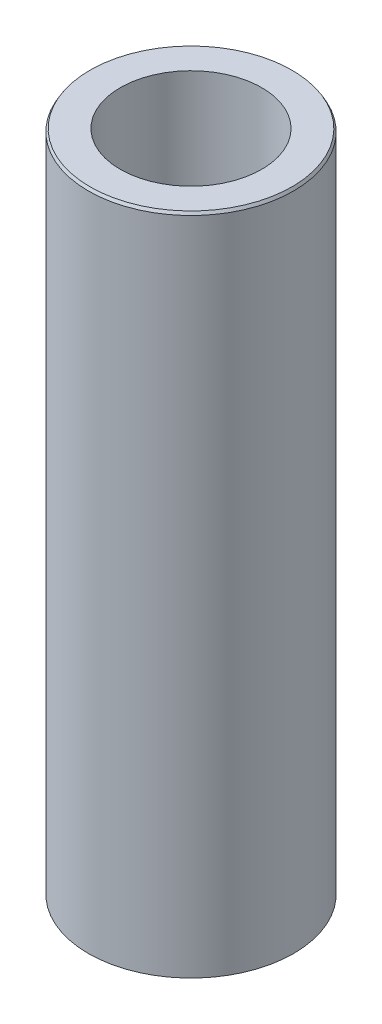
ISO-10303-21;
HEADER;
FILE_DESCRIPTION(('STEP AP214'),'2;1');
FILE_NAME('part.step','',(''),(''),'','','');
FILE_SCHEMA(('AUTOMOTIVE_DESIGN { 1 0 10303 214 1 1 1 1 }'));
ENDSEC;
DATA;
#1=APPLICATION_CONTEXT('core data for automotive mechanical design processes');
#2=APPLICATION_PROTOCOL_DEFINITION('international standard','automotive_design',2000,#1);
#3=PRODUCT_CONTEXT('',#1,'mechanical');
#4=PRODUCT('Part','Part','',(#3));
#5=PRODUCT_RELATED_PRODUCT_CATEGORY('part','',(#4));
#6=PRODUCT_DEFINITION_FORMATION('','',#4);
#7=PRODUCT_DEFINITION_CONTEXT('part definition',#1,'design');
#8=PRODUCT_DEFINITION('design','',#6,#7);
#9=PRODUCT_DEFINITION_SHAPE('','',#8);
#10=(LENGTH_UNIT() NAMED_UNIT(*) SI_UNIT(.MILLI.,.METRE.));
#11=(NAMED_UNIT(*) PLANE_ANGLE_UNIT() SI_UNIT($,.RADIAN.));
#12=(NAMED_UNIT(*) SI_UNIT($,.STERADIAN.) SOLID_ANGLE_UNIT());
#13=UNCERTAINTY_MEASURE_WITH_UNIT(LENGTH_MEASURE(1.E-05),#10,'distance_accuracy_value','');
#14=(GEOMETRIC_REPRESENTATION_CONTEXT(3) GLOBAL_UNCERTAINTY_ASSIGNED_CONTEXT((#13)) GLOBAL_UNIT_ASSIGNED_CONTEXT((#10,
#11,#12)) REPRESENTATION_CONTEXT('',''));
#15=CARTESIAN_POINT('',(0.,0.,0.));
#16=DIRECTION('',(0.,0.,1.));
#17=DIRECTION('',(1.,0.,0.));
#18=AXIS2_PLACEMENT_3D('',#15,#16,#17);
#19=CARTESIAN_POINT('',(0.,259.075646590903,0.));
#20=DIRECTION('',(0.,-1.,0.));
#21=DIRECTION('',(0.,0.,-1.));
#22=AXIS2_PLACEMENT_3D('',#19,#20,#21);
#23=CYLINDRICAL_SURFACE('',#22,40.);
#24=CARTESIAN_POINT('',(0.,257.984166966199,0.));
#25=DIRECTION('',(0.,1.,0.));
#26=DIRECTION('',(0.,0.,1.));
#27=AXIS2_PLACEMENT_3D('',#24,#25,#26);
#28=CIRCLE('',#27,40.);
#29=CARTESIAN_POINT('',(0.,257.984166966199,40.));
#30=VERTEX_POINT('',#29);
#31=EDGE_CURVE('E50',#30,#30,#28,.F.);
#32=ORIENTED_EDGE('',*,*,#31,.T.);
#33=EDGE_LOOP('',(#32));
#34=FACE_BOUND('',#33,.T.);
#35=CARTESIAN_POINT('',(0.,0.630166055137771,0.));
#36=DIRECTION('',(0.,1.,0.));
#37=DIRECTION('',(0.,0.,1.));
#38=AXIS2_PLACEMENT_3D('',#35,#36,#37);
#39=CIRCLE('',#38,40.);
#40=CARTESIAN_POINT('',(0.,0.630166055137771,40.));
#41=VERTEX_POINT('',#40);
#42=EDGE_CURVE('E51',#41,#41,#39,.T.);
#43=ORIENTED_EDGE('',*,*,#42,.T.);
#44=EDGE_LOOP('',(#43));
#45=FACE_BOUND('',#44,.T.);
#46=ADVANCED_FACE('F39',(#34,#45),#23,.T.);
#47=CARTESIAN_POINT('',(0.,259.075646590903,0.));
#48=DIRECTION('',(0.,1.,0.));
#49=DIRECTION('',(0.,0.,1.));
#50=AXIS2_PLACEMENT_3D('',#47,#48,#49);
#51=PLANE('',#50);
#52=CARTESIAN_POINT('',(0.,259.075646590903,0.));
#53=DIRECTION('',(0.,1.,0.));
#54=DIRECTION('',(0.,0.,1.));
#55=AXIS2_PLACEMENT_3D('',#52,#53,#54);
#56=CIRCLE('',#55,39.3698339448623);
#57=CARTESIAN_POINT('',(0.,259.075646590903,39.3698339448623));
#58=VERTEX_POINT('',#57);
#59=EDGE_CURVE('E54',#58,#58,#56,.T.);
#60=ORIENTED_EDGE('',*,*,#59,.T.);
#61=EDGE_LOOP('',(#60));
#62=FACE_BOUND('',#61,.T.);
#63=CARTESIAN_POINT('',(0.,259.075646590903,0.));
#64=DIRECTION('',(0.,1.,0.));
#65=DIRECTION('',(0.,0.,1.));
#66=AXIS2_PLACEMENT_3D('',#63,#64,#65);
#67=CIRCLE('',#66,27.580915956012);
#68=CARTESIAN_POINT('',(0.,259.075646590903,27.580915956012));
#69=VERTEX_POINT('',#68);
#70=EDGE_CURVE('E58',#69,#69,#67,.T.);
#71=ORIENTED_EDGE('',*,*,#70,.F.);
#72=EDGE_LOOP('',(#71));
#73=FACE_BOUND('',#72,.T.);
#74=ADVANCED_FACE('F69',(#62,#73),#51,.T.);
#75=CARTESIAN_POINT('',(0.,0.,0.));
#76=DIRECTION('',(0.,1.,0.));
#77=DIRECTION('',(0.,0.,1.));
#78=AXIS2_PLACEMENT_3D('',#75,#76,#77);
#79=PLANE('',#78);
#80=CARTESIAN_POINT('',(0.,0.,0.));
#81=DIRECTION('',(0.,1.,0.));
#82=DIRECTION('',(0.,0.,1.));
#83=AXIS2_PLACEMENT_3D('',#80,#81,#82);
#84=CIRCLE('',#83,38.9085203752961);
#85=CARTESIAN_POINT('',(0.,0.,38.9085203752961));
#86=VERTEX_POINT('',#85);
#87=EDGE_CURVE('E10',#86,#86,#84,.F.);
#88=ORIENTED_EDGE('',*,*,#87,.T.);
#89=EDGE_LOOP('',(#88));
#90=FACE_BOUND('',#89,.T.);
#91=CARTESIAN_POINT('',(0.,0.,0.));
#92=DIRECTION('',(0.,1.,0.));
#93=DIRECTION('',(0.,0.,1.));
#94=AXIS2_PLACEMENT_3D('',#91,#92,#93);
#95=CIRCLE('',#94,27.580915956012);
#96=CARTESIAN_POINT('',(0.,0.,27.580915956012));
#97=VERTEX_POINT('',#96);
#98=EDGE_CURVE('E63',#97,#97,#95,.T.);
#99=ORIENTED_EDGE('',*,*,#98,.T.);
#100=EDGE_LOOP('',(#99));
#101=FACE_BOUND('',#100,.T.);
#102=ADVANCED_FACE('F75',(#90,#101),#79,.F.);
#103=CARTESIAN_POINT('',(0.,259.075646590903,0.));
#104=DIRECTION('',(0.,-1.,0.));
#105=DIRECTION('',(0.,0.,-1.));
#106=AXIS2_PLACEMENT_3D('',#103,#104,#105);
#107=CYLINDRICAL_SURFACE('',#106,27.580915956012);
#108=ORIENTED_EDGE('',*,*,#70,.T.);
#109=EDGE_LOOP('',(#108));
#110=FACE_BOUND('',#109,.T.);
#111=ORIENTED_EDGE('',*,*,#98,.F.);
#112=EDGE_LOOP('',(#111));
#113=FACE_BOUND('',#112,.T.);
#114=ADVANCED_FACE('F70',(#110,#113),#107,.F.);
#115=CARTESIAN_POINT('',(0.,259.075646590903,0.));
#116=DIRECTION('',(0.,-1.,0.));
#117=DIRECTION('',(0.,0.,-1.));
#118=AXIS2_PLACEMENT_3D('',#115,#116,#117);
#119=CONICAL_SURFACE('',#118,39.3698339448623,0.523598775598305);
#120=ORIENTED_EDGE('',*,*,#31,.F.);
#121=EDGE_LOOP('',(#120));
#122=FACE_BOUND('',#121,.T.);
#123=ORIENTED_EDGE('',*,*,#59,.F.);
#124=EDGE_LOOP('',(#123));
#125=FACE_BOUND('',#124,.T.);
#126=ADVANCED_FACE('F81',(#122,#125),#119,.T.);
#127=CARTESIAN_POINT('',(0.,0.630166055137771,0.));
#128=DIRECTION('',(0.,1.,0.));
#129=DIRECTION('',(0.,0.,1.));
#130=AXIS2_PLACEMENT_3D('',#127,#128,#129);
#131=CONICAL_SURFACE('',#130,40.,1.04719755119661);
#132=ORIENTED_EDGE('',*,*,#87,.F.);
#133=EDGE_LOOP('',(#132));
#134=FACE_BOUND('',#133,.T.);
#135=ORIENTED_EDGE('',*,*,#42,.F.);
#136=EDGE_LOOP('',(#135));
#137=FACE_BOUND('',#136,.T.);
#138=ADVANCED_FACE('F45',(#134,#137),#131,.T.);
#139=CLOSED_SHELL('',(#46,#74,#102,#114,#126,#138));
#140=MANIFOLD_SOLID_BREP('B2',#139);
#141=ADVANCED_BREP_SHAPE_REPRESENTATION('',(#18,#140),#14);
#142=SHAPE_DEFINITION_REPRESENTATION(#9,#141);
ENDSEC;
END-ISO-10303-21;
